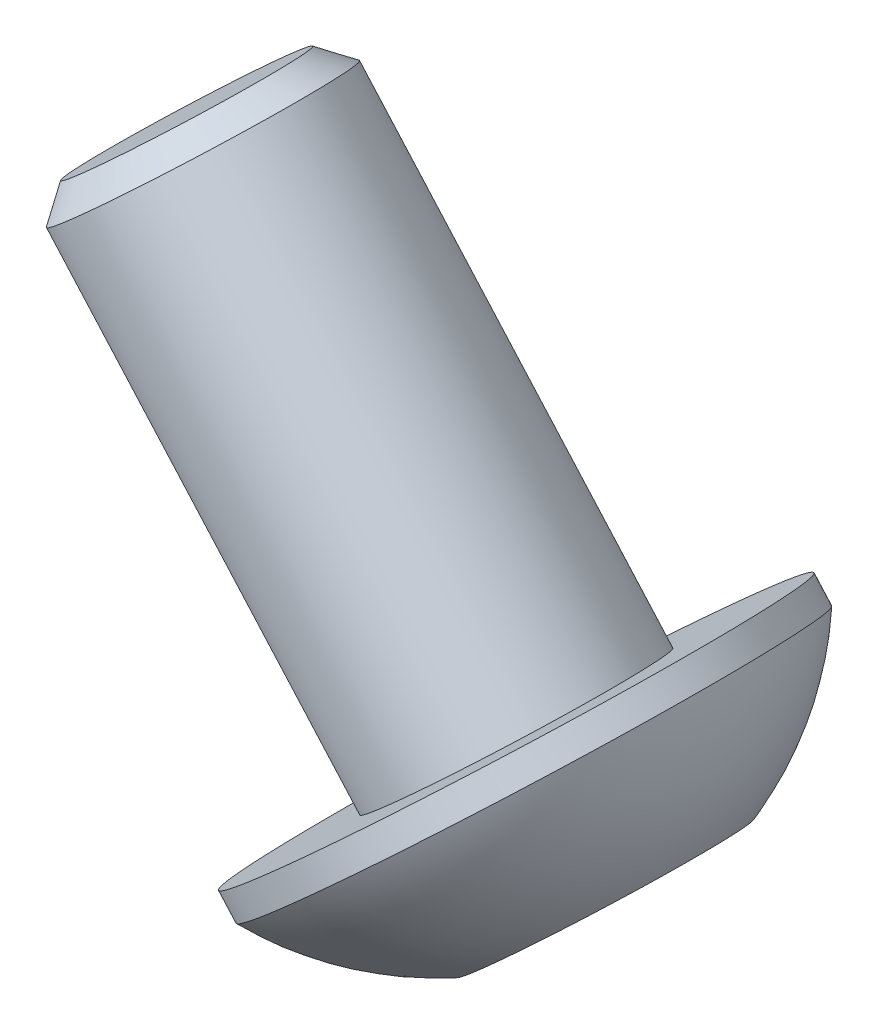
ISO-10303-21;
HEADER;
FILE_DESCRIPTION(('STEP AP214'),'2;1');
FILE_NAME('part.step','',(''),(''),'','','');
FILE_SCHEMA(('AUTOMOTIVE_DESIGN { 1 0 10303 214 1 1 1 1 }'));
ENDSEC;
DATA;
#1=APPLICATION_CONTEXT('core data for automotive mechanical design processes');
#2=APPLICATION_PROTOCOL_DEFINITION('international standard','automotive_design',2000,#1);
#3=PRODUCT_CONTEXT('',#1,'mechanical');
#4=PRODUCT('Part','Part','',(#3));
#5=PRODUCT_RELATED_PRODUCT_CATEGORY('part','',(#4));
#6=PRODUCT_DEFINITION_FORMATION('','',#4);
#7=PRODUCT_DEFINITION_CONTEXT('part definition',#1,'design');
#8=PRODUCT_DEFINITION('design','',#6,#7);
#9=PRODUCT_DEFINITION_SHAPE('','',#8);
#10=(LENGTH_UNIT() NAMED_UNIT(*) SI_UNIT(.MILLI.,.METRE.));
#11=(NAMED_UNIT(*) PLANE_ANGLE_UNIT() SI_UNIT($,.RADIAN.));
#12=(NAMED_UNIT(*) SI_UNIT($,.STERADIAN.) SOLID_ANGLE_UNIT());
#13=UNCERTAINTY_MEASURE_WITH_UNIT(LENGTH_MEASURE(1.E-05),#10,'distance_accuracy_value','');
#14=(GEOMETRIC_REPRESENTATION_CONTEXT(3) GLOBAL_UNCERTAINTY_ASSIGNED_CONTEXT((#13)) GLOBAL_UNIT_ASSIGNED_CONTEXT((#10,
#11,#12)) REPRESENTATION_CONTEXT('',''));
#15=CARTESIAN_POINT('',(0.,0.,0.));
#16=DIRECTION('',(0.,0.,1.));
#17=DIRECTION('',(1.,0.,0.));
#18=AXIS2_PLACEMENT_3D('',#15,#16,#17);
#19=CARTESIAN_POINT('',(80.7619107019577,-15.7951499203464,-42.3844999999999));
#20=DIRECTION('',(0.664699798962186,-0.747110552234159,0.));
#21=DIRECTION('',(0.747110552234159,0.664699798962186,0.));
#22=AXIS2_PLACEMENT_3D('',#19,#20,#21);
#23=CONICAL_SURFACE('',#22,1.58750000000284,1.04719755119654);
#24=CARTESIAN_POINT('',(80.1526843869771,-15.1103905608109,-42.3844999999999));
#25=VERTEX_POINT('',#24);
#26=VERTEX_LOOP('',#25);
#27=FACE_BOUND('',#26,.T.);
#28=CARTESIAN_POINT('',(80.7619107019576,-15.7951499203463,-42.3844999999999));
#29=DIRECTION('',(0.664699798962185,-0.747110552234159,0.));
#30=DIRECTION('',(0.747110552234159,0.664699798962185,0.));
#31=AXIS2_PLACEMENT_3D('',#28,#29,#30);
#32=CIRCLE('',#31,1.5875000000028);
#33=CARTESIAN_POINT('',(80.360317561987,-16.1524449399484,-40.8907732951104));
#34=VERTEX_POINT('',#33);
#35=CARTESIAN_POINT('',(81.5275802816676,-15.1139382654177,-41.1721233976598));
#36=VERTEX_POINT('',#35);
#37=EDGE_CURVE('E88',#34,#36,#32,.F.);
#38=ORIENTED_EDGE('',*,*,#37,.F.);
#39=CARTESIAN_POINT('',(80.7619107019575,-15.7951499203461,-42.3844999999999));
#40=DIRECTION('',(0.664699798962186,-0.747110552234159,0.));
#41=DIRECTION('',(0.747110552234159,0.664699798962186,0.));
#42=AXIS2_PLACEMENT_3D('',#39,#40,#41);
#43=CIRCLE('',#42,1.58750000000214);
#44=CARTESIAN_POINT('',(79.5946479822795,-16.8336565948782,-42.1031498974503));
#45=VERTEX_POINT('',#44);
#46=EDGE_CURVE('E90',#34,#45,#43,.T.);
#47=ORIENTED_EDGE('',*,*,#46,.T.);
#48=CARTESIAN_POINT('',(80.7619107019576,-15.7951499203463,-42.3844999999999));
#49=DIRECTION('',(0.664699798962186,-0.747110552234159,0.));
#50=DIRECTION('',(0.747110552234159,0.664699798962186,0.));
#51=AXIS2_PLACEMENT_3D('',#48,#49,#50);
#52=CIRCLE('',#51,1.58750000000259);
#53=CARTESIAN_POINT('',(79.9962411222521,-16.4763615752782,-43.5968766023401));
#54=VERTEX_POINT('',#53);
#55=EDGE_CURVE('E106',#45,#54,#52,.T.);
#56=ORIENTED_EDGE('',*,*,#55,.T.);
#57=CARTESIAN_POINT('',(80.7619107019577,-15.7951499203464,-42.3844999999999));
#58=DIRECTION('',(0.664699798962186,-0.747110552234159,0.));
#59=DIRECTION('',(0.747110552234159,0.664699798962186,0.));
#60=AXIS2_PLACEMENT_3D('',#57,#58,#59);
#61=CIRCLE('',#60,1.58750000000284);
#62=CARTESIAN_POINT('',(81.1635038419326,-15.4378549007474,-43.8782267048898));
#63=VERTEX_POINT('',#62);
#64=EDGE_CURVE('E316',#54,#63,#61,.T.);
#65=ORIENTED_EDGE('',*,*,#64,.T.);
#66=CARTESIAN_POINT('',(80.761910701958,-15.7951499203467,-42.3844999999999));
#67=DIRECTION('',(0.664699798962185,-0.747110552234159,0.));
#68=DIRECTION('',(0.747110552234159,0.664699798962185,0.));
#69=AXIS2_PLACEMENT_3D('',#66,#67,#68);
#70=CIRCLE('',#69,1.58750000000375);
#71=CARTESIAN_POINT('',(81.9291734216403,-14.7566432458173,-42.6658501025492));
#72=VERTEX_POINT('',#71);
#73=EDGE_CURVE('E318',#72,#63,#70,.F.);
#74=ORIENTED_EDGE('',*,*,#73,.F.);
#75=CARTESIAN_POINT('',(80.7619107019579,-15.7951499203467,-42.3844999999999));
#76=DIRECTION('',(0.664699798962185,-0.747110552234159,0.));
#77=DIRECTION('',(0.747110552234159,0.664699798962185,0.));
#78=AXIS2_PLACEMENT_3D('',#75,#76,#77);
#79=CIRCLE('',#78,1.58750000000355);
#80=EDGE_CURVE('E93',#36,#72,#79,.F.);
#81=ORIENTED_EDGE('',*,*,#80,.F.);
#82=EDGE_LOOP('',(#38,#47,#56,#65,#74,#81));
#83=FACE_BOUND('',#82,.T.);
#84=ADVANCED_FACE('F16',(#27,#83),#23,.F.);
#85=CARTESIAN_POINT('',(83.0964361413198,-13.7181365712904,-42.9472002050976));
#86=DIRECTION('',(-0.664699798962185,0.747110552234159,0.));
#87=DIRECTION('',(-0.747110552234159,-0.664699798962185,0.));
#88=AXIS2_PLACEMENT_3D('',#85,#86,#87);
#89=PLANE('',#88);
#90=DIRECTION('',(0.570569671111538,0.507632430766113,-0.645569179594379));
#91=VECTOR('',#90,1.);
#92=CARTESIAN_POINT('',(81.0046283284516,-15.5792054967968,-40.5804311285149));
#93=LINE('',#92,#91);
#94=CARTESIAN_POINT('',(81.0046283284516,-15.5792054967968,-40.5804311285149));
#95=VERTEX_POINT('',#94);
#96=EDGE_CURVE('E111',#95,#36,#93,.T.);
#97=ORIENTED_EDGE('',*,*,#96,.F.);
#98=DIRECTION('',(0.702978887166101,0.625436119964289,0.338600567103374));
#99=VECTOR('',#98,1.);
#100=CARTESIAN_POINT('',(80.3603175619894,-16.1524449399496,-40.8907732951117));
#101=LINE('',#100,#99);
#102=EDGE_CURVE('E109',#34,#95,#101,.T.);
#103=ORIENTED_EDGE('',*,*,#102,.F.);
#104=ORIENTED_EDGE('',*,*,#37,.T.);
#105=EDGE_LOOP('',(#97,#103,#104));
#106=FACE_BOUND('',#105,.T.);
#107=ADVANCED_FACE('F110',(#106),#89,.F.);
#108=CARTESIAN_POINT('',(83.0964361413198,-13.7181365712904,-42.9472002050976));
#109=DIRECTION('',(-0.664699798962185,0.747110552234159,0.));
#110=DIRECTION('',(-0.747110552234159,-0.664699798962185,0.));
#111=AXIS2_PLACEMENT_3D('',#108,#109,#110);
#112=PLANE('',#111);
#113=DIRECTION('',(0.132409216054471,0.117803689198278,0.984169746697751));
#114=VECTOR('',#113,1.);
#115=CARTESIAN_POINT('',(81.8078146083959,-14.8646154575964,-43.5678845382916));
#116=LINE('',#115,#114);
#117=CARTESIAN_POINT('',(82.0505322348858,-14.6486710340436,-41.7638156668065));
#118=VERTEX_POINT('',#117);
#119=EDGE_CURVE('E159',#118,#72,#116,.F.);
#120=ORIENTED_EDGE('',*,*,#119,.F.);
#121=DIRECTION('',(0.570569671111515,0.507632430766135,-0.645569179594382));
#122=VECTOR('',#121,1.);
#123=CARTESIAN_POINT('',(81.5275802816688,-15.1139382654201,-41.1721233976607));
#124=LINE('',#123,#122);
#125=EDGE_CURVE('E171',#36,#118,#124,.T.);
#126=ORIENTED_EDGE('',*,*,#125,.F.);
#127=ORIENTED_EDGE('',*,*,#80,.T.);
#128=EDGE_LOOP('',(#120,#126,#127));
#129=FACE_BOUND('',#128,.T.);
#130=ADVANCED_FACE('F247',(#129),#112,.F.);
#131=CARTESIAN_POINT('',(83.0964361413198,-13.7181365712904,-42.9472002050976));
#132=DIRECTION('',(-0.664699798962185,0.747110552234159,0.));
#133=DIRECTION('',(-0.747110552234159,-0.664699798962185,0.));
#134=AXIS2_PLACEMENT_3D('',#131,#132,#133);
#135=PLANE('',#134);
#136=DIRECTION('',(-0.702978887165938,-0.625436119964469,-0.338600567103377));
#137=VECTOR('',#136,1.);
#138=CARTESIAN_POINT('',(81.8078146083957,-14.8646154575964,-43.5678845382913));
#139=LINE('',#138,#137);
#140=CARTESIAN_POINT('',(81.8078146083959,-14.8646154575965,-43.5678845382913));
#141=VERTEX_POINT('',#140);
#142=EDGE_CURVE('E143',#141,#63,#139,.T.);
#143=ORIENTED_EDGE('',*,*,#142,.F.);
#144=DIRECTION('',(0.132409216054471,0.117803689198278,0.984169746697751));
#145=VECTOR('',#144,1.);
#146=CARTESIAN_POINT('',(81.8078146083961,-14.8646154575966,-43.5678845382916));
#147=LINE('',#146,#145);
#148=EDGE_CURVE('E156',#72,#141,#147,.F.);
#149=ORIENTED_EDGE('',*,*,#148,.F.);
#150=ORIENTED_EDGE('',*,*,#73,.T.);
#151=EDGE_LOOP('',(#143,#149,#150));
#152=FACE_BOUND('',#151,.T.);
#153=ADVANCED_FACE('F243',(#152),#135,.F.);
#154=CARTESIAN_POINT('',(83.0964361413198,-13.7181365712904,-42.9472002050976));
#155=DIRECTION('',(-0.664699798962185,0.747110552234159,0.));
#156=DIRECTION('',(-0.747110552234159,-0.664699798962185,0.));
#157=AXIS2_PLACEMENT_3D('',#154,#155,#156);
#158=PLANE('',#157);
#159=DIRECTION('',(-0.570569671111317,-0.507632430766363,0.645569179594378));
#160=VECTOR('',#159,1.);
#161=CARTESIAN_POINT('',(80.5191930754717,-16.0110943439026,-44.1885688714847));
#162=LINE('',#161,#160);
#163=CARTESIAN_POINT('',(80.5191930754717,-16.0110943439026,-44.1885688714848));
#164=VERTEX_POINT('',#163);
#165=EDGE_CURVE('E128',#164,#54,#162,.T.);
#166=ORIENTED_EDGE('',*,*,#165,.F.);
#167=DIRECTION('',(-0.702978887165886,-0.62543611996453,-0.338600567103373));
#168=VECTOR('',#167,1.);
#169=CARTESIAN_POINT('',(81.1635038419336,-15.4378549007496,-43.8782267048881));
#170=LINE('',#169,#168);
#171=EDGE_CURVE('E140',#63,#164,#170,.T.);
#172=ORIENTED_EDGE('',*,*,#171,.F.);
#173=ORIENTED_EDGE('',*,*,#64,.F.);
#174=EDGE_LOOP('',(#166,#172,#173));
#175=FACE_BOUND('',#174,.T.);
#176=ADVANCED_FACE('F239',(#175),#158,.F.);
#177=CARTESIAN_POINT('',(83.0964361413198,-13.7181365712904,-42.9472002050976));
#178=DIRECTION('',(-0.664699798962185,0.747110552234159,0.));
#179=DIRECTION('',(-0.747110552234159,-0.664699798962185,0.));
#180=AXIS2_PLACEMENT_3D('',#177,#178,#179);
#181=PLANE('',#180);
#182=DIRECTION('',(0.132409216054471,0.117803689198279,0.984169746697751));
#183=VECTOR('',#182,1.);
#184=CARTESIAN_POINT('',(79.7160067955274,-16.7256843831031,-41.2011154617082));
#185=LINE('',#184,#183);
#186=CARTESIAN_POINT('',(79.4732891690375,-16.9416288066559,-43.0051843331932));
#187=VERTEX_POINT('',#186);
#188=EDGE_CURVE('E148',#187,#45,#185,.T.);
#189=ORIENTED_EDGE('',*,*,#188,.F.);
#190=DIRECTION('',(-0.570569671111649,-0.507632430765987,0.64556917959438));
#191=VECTOR('',#190,1.);
#192=CARTESIAN_POINT('',(79.9962411222546,-16.4763615752795,-43.5968766023389));
#193=LINE('',#192,#191);
#194=EDGE_CURVE('E125',#54,#187,#193,.T.);
#195=ORIENTED_EDGE('',*,*,#194,.F.);
#196=ORIENTED_EDGE('',*,*,#55,.F.);
#197=EDGE_LOOP('',(#189,#195,#196));
#198=FACE_BOUND('',#197,.T.);
#199=ADVANCED_FACE('F236',(#198),#181,.F.);
#200=CARTESIAN_POINT('',(83.0964361413198,-13.7181365712904,-42.9472002050976));
#201=DIRECTION('',(-0.664699798962185,0.747110552234159,0.));
#202=DIRECTION('',(-0.747110552234159,-0.664699798962185,0.));
#203=AXIS2_PLACEMENT_3D('',#200,#201,#202);
#204=PLANE('',#203);
#205=DIRECTION('',(0.702978887165781,0.625436119964652,0.338600567103367));
#206=VECTOR('',#205,1.);
#207=CARTESIAN_POINT('',(79.7160067955274,-16.7256843831029,-41.2011154617085));
#208=LINE('',#207,#206);
#209=CARTESIAN_POINT('',(79.7160067955273,-16.7256843831029,-41.2011154617083));
#210=VERTEX_POINT('',#209);
#211=EDGE_CURVE('E101',#210,#34,#208,.T.);
#212=ORIENTED_EDGE('',*,*,#211,.F.);
#213=DIRECTION('',(0.132409216054471,0.117803689198279,0.984169746697751));
#214=VECTOR('',#213,1.);
#215=CARTESIAN_POINT('',(79.7160067955272,-16.7256843831028,-41.2011154617082));
#216=LINE('',#215,#214);
#217=EDGE_CURVE('E104',#45,#210,#216,.T.);
#218=ORIENTED_EDGE('',*,*,#217,.F.);
#219=ORIENTED_EDGE('',*,*,#46,.F.);
#220=EDGE_LOOP('',(#212,#218,#219));
#221=FACE_BOUND('',#220,.T.);
#222=ADVANCED_FACE('F99',(#221),#204,.F.);
#223=CARTESIAN_POINT('',(81.0046283284516,-15.5792054967967,-40.5804311285149));
#224=DIRECTION('',(0.2529720566754,0.225067728882094,-0.940930207803573));
#225=DIRECTION('',(-0.965707241664354,0.,-0.259633440444457));
#226=AXIS2_PLACEMENT_3D('',#223,#224,#225);
#227=PLANE('',#226);
#228=DIRECTION('',(0.702978887165965,0.625436119964515,0.338600567103238));
#229=VECTOR('',#228,1.);
#230=CARTESIAN_POINT('',(80.8978430380818,-18.0540469449756,-41.2011154617084));
#231=LINE('',#230,#229);
#232=CARTESIAN_POINT('',(80.8978430380819,-18.0540469449755,-41.2011154617085));
#233=VERTEX_POINT('',#232);
#234=CARTESIAN_POINT('',(82.1864645710058,-16.9075680586693,-40.580431128515));
#235=VERTEX_POINT('',#234);
#236=EDGE_CURVE('E132',#233,#235,#231,.T.);
#237=ORIENTED_EDGE('',*,*,#236,.F.);
#238=DIRECTION('',(-0.664699798962186,0.747110552234159,0.));
#239=VECTOR('',#238,1.);
#240=CARTESIAN_POINT('',(79.7160067955273,-16.725684383103,-41.2011154617082));
#241=LINE('',#240,#239);
#242=EDGE_CURVE('E117',#210,#233,#241,.F.);
#243=ORIENTED_EDGE('',*,*,#242,.F.);
#244=ORIENTED_EDGE('',*,*,#211,.T.);
#245=ORIENTED_EDGE('',*,*,#102,.T.);
#246=DIRECTION('',(-0.664699798962094,0.747110552234241,0.));
#247=VECTOR('',#246,1.);
#248=CARTESIAN_POINT('',(82.186464571006,-16.9075680586691,-40.5804311285148));
#249=LINE('',#248,#247);
#250=EDGE_CURVE('E168',#235,#95,#249,.T.);
#251=ORIENTED_EDGE('',*,*,#250,.F.);
#252=EDGE_LOOP('',(#237,#243,#244,#245,#251));
#253=FACE_BOUND('',#252,.T.);
#254=ADVANCED_FACE('F115',(#253),#227,.T.);
#255=CARTESIAN_POINT('',(82.0505322348859,-14.6486710340435,-41.7638156668064));
#256=DIRECTION('',(-0.48231154627211,-0.429109703892566,-0.763701796749124));
#257=DIRECTION('',(-0.84550211395615,0.,0.53397207351666));
#258=AXIS2_PLACEMENT_3D('',#255,#256,#257);
#259=PLANE('',#258);
#260=DIRECTION('',(0.570569671111426,0.507632430766176,-0.645569179594428));
#261=VECTOR('',#260,1.);
#262=CARTESIAN_POINT('',(82.1864645710059,-16.9075680586695,-40.5804311285152));
#263=LINE('',#262,#261);
#264=CARTESIAN_POINT('',(83.2323684774403,-15.977033595916,-41.7638156668064));
#265=VERTEX_POINT('',#264);
#266=EDGE_CURVE('E301',#235,#265,#263,.T.);
#267=ORIENTED_EDGE('',*,*,#266,.F.);
#268=ORIENTED_EDGE('',*,*,#250,.T.);
#269=ORIENTED_EDGE('',*,*,#96,.T.);
#270=ORIENTED_EDGE('',*,*,#125,.T.);
#271=DIRECTION('',(0.664699798962185,-0.74711055223416,0.));
#272=VECTOR('',#271,1.);
#273=CARTESIAN_POINT('',(82.0505322348857,-14.6486710340436,-41.7638156668067));
#274=LINE('',#273,#272);
#275=EDGE_CURVE('E153',#265,#118,#274,.F.);
#276=ORIENTED_EDGE('',*,*,#275,.F.);
#277=EDGE_LOOP('',(#267,#268,#269,#270,#276));
#278=FACE_BOUND('',#277,.T.);
#279=ADVANCED_FACE('F227',(#278),#259,.T.);
#280=CARTESIAN_POINT('',(81.8078146083958,-14.8646154575964,-43.5678845382916));
#281=DIRECTION('',(-0.73528360294751,-0.65417743277466,0.177228411054447));
#282=DIRECTION('',(0.664699798962185,-0.74711055223416,0.));
#283=AXIS2_PLACEMENT_3D('',#280,#281,#282);
#284=PLANE('',#283);
#285=DIRECTION('',(-0.132409216054484,-0.117803689198291,-0.984169746697748));
#286=VECTOR('',#285,1.);
#287=CARTESIAN_POINT('',(83.2323684774401,-15.9770335959161,-41.7638156668066));
#288=LINE('',#287,#286);
#289=CARTESIAN_POINT('',(82.9896508509504,-16.1929780194688,-43.5678845382916));
#290=VERTEX_POINT('',#289);
#291=EDGE_CURVE('E298',#265,#290,#288,.T.);
#292=ORIENTED_EDGE('',*,*,#291,.F.);
#293=ORIENTED_EDGE('',*,*,#275,.T.);
#294=ORIENTED_EDGE('',*,*,#119,.T.);
#295=ORIENTED_EDGE('',*,*,#148,.T.);
#296=DIRECTION('',(-0.664699798962021,0.747110552234305,0.));
#297=VECTOR('',#296,1.);
#298=CARTESIAN_POINT('',(82.9896508509502,-16.192978019469,-43.5678845382914));
#299=LINE('',#298,#297);
#300=EDGE_CURVE('E137',#290,#141,#299,.T.);
#301=ORIENTED_EDGE('',*,*,#300,.F.);
#302=EDGE_LOOP('',(#292,#293,#294,#295,#301));
#303=FACE_BOUND('',#302,.T.);
#304=ADVANCED_FACE('F223',(#303),#284,.T.);
#305=CARTESIAN_POINT('',(80.5191930754716,-16.0110943439027,-44.1885688714848));
#306=DIRECTION('',(-0.2529720566754,-0.225067728882094,0.940930207803573));
#307=DIRECTION('',(0.965707241664354,0.,0.259633440444457));
#308=AXIS2_PLACEMENT_3D('',#305,#306,#307);
#309=PLANE('',#308);
#310=DIRECTION('',(-0.702978887165984,-0.62543611996453,-0.33860056710317));
#311=VECTOR('',#310,1.);
#312=CARTESIAN_POINT('',(82.9896508509502,-16.1929780194689,-43.5678845382916));
#313=LINE('',#312,#311);
#314=CARTESIAN_POINT('',(81.7010293180259,-17.3394569057752,-44.1885688714848));
#315=VERTEX_POINT('',#314);
#316=EDGE_CURVE('E295',#290,#315,#313,.T.);
#317=ORIENTED_EDGE('',*,*,#316,.F.);
#318=ORIENTED_EDGE('',*,*,#300,.T.);
#319=ORIENTED_EDGE('',*,*,#142,.T.);
#320=ORIENTED_EDGE('',*,*,#171,.T.);
#321=DIRECTION('',(-0.664699798962043,0.747110552234286,-1.6000823962893E-13));
#322=VECTOR('',#321,1.);
#323=CARTESIAN_POINT('',(81.701029318026,-17.339456905775,-44.1885688714844));
#324=LINE('',#323,#322);
#325=EDGE_CURVE('E127',#315,#164,#324,.T.);
#326=ORIENTED_EDGE('',*,*,#325,.F.);
#327=EDGE_LOOP('',(#317,#318,#319,#320,#326));
#328=FACE_BOUND('',#327,.T.);
#329=ADVANCED_FACE('F220',(#328),#309,.T.);
#330=CARTESIAN_POINT('',(79.4732891690372,-16.9416288066561,-43.0051843331931));
#331=DIRECTION('',(0.482311546272109,0.429109703892566,0.763701796749125));
#332=DIRECTION('',(0.845502113956151,0.,-0.533972073516659));
#333=AXIS2_PLACEMENT_3D('',#330,#331,#332);
#334=PLANE('',#333);
#335=DIRECTION('',(-0.570569671111371,-0.507632430766128,0.645569179594514));
#336=VECTOR('',#335,1.);
#337=CARTESIAN_POINT('',(81.7010293180258,-17.3394569057753,-44.1885688714848));
#338=LINE('',#337,#336);
#339=CARTESIAN_POINT('',(80.6551254115918,-18.2699913685284,-43.0051843331931));
#340=VERTEX_POINT('',#339);
#341=EDGE_CURVE('E292',#315,#340,#338,.T.);
#342=ORIENTED_EDGE('',*,*,#341,.F.);
#343=ORIENTED_EDGE('',*,*,#325,.T.);
#344=ORIENTED_EDGE('',*,*,#165,.T.);
#345=ORIENTED_EDGE('',*,*,#194,.T.);
#346=DIRECTION('',(-0.664699798962186,0.747110552234159,0.));
#347=VECTOR('',#346,1.);
#348=CARTESIAN_POINT('',(79.4732891690375,-16.9416288066558,-43.0051843331933));
#349=LINE('',#348,#347);
#350=EDGE_CURVE('E34',#340,#187,#349,.T.);
#351=ORIENTED_EDGE('',*,*,#350,.F.);
#352=EDGE_LOOP('',(#342,#343,#344,#345,#351));
#353=FACE_BOUND('',#352,.T.);
#354=ADVANCED_FACE('F216',(#353),#334,.T.);
#355=CARTESIAN_POINT('',(79.7160067955273,-16.725684383103,-41.2011154617082));
#356=DIRECTION('',(0.735283602947509,0.65417743277466,-0.177228411054447));
#357=DIRECTION('',(-0.664699798962186,0.747110552234159,0.));
#358=AXIS2_PLACEMENT_3D('',#355,#356,#357);
#359=PLANE('',#358);
#360=DIRECTION('',(0.132409216054649,0.117803689198438,0.984169746697708));
#361=VECTOR('',#360,1.);
#362=CARTESIAN_POINT('',(80.6551254115917,-18.2699913685286,-43.0051843331931));
#363=LINE('',#362,#361);
#364=EDGE_CURVE('E197',#340,#233,#363,.T.);
#365=ORIENTED_EDGE('',*,*,#364,.F.);
#366=ORIENTED_EDGE('',*,*,#350,.T.);
#367=ORIENTED_EDGE('',*,*,#188,.T.);
#368=ORIENTED_EDGE('',*,*,#217,.T.);
#369=ORIENTED_EDGE('',*,*,#242,.T.);
#370=EDGE_LOOP('',(#365,#366,#367,#368,#369));
#371=FACE_BOUND('',#370,.T.);
#372=ADVANCED_FACE('F212',(#371),#359,.T.);
#373=CARTESIAN_POINT('',(81.9437469445159,-17.1235124822224,-42.3845000000001));
#374=DIRECTION('',(0.664699798962186,-0.747110552234159,0.));
#375=DIRECTION('',(0.747110552234159,0.664699798962186,0.));
#376=AXIS2_PLACEMENT_3D('',#373,#374,#375);
#377=PLANE('',#376);
#378=ORIENTED_EDGE('',*,*,#341,.T.);
#379=ORIENTED_EDGE('',*,*,#364,.T.);
#380=ORIENTED_EDGE('',*,*,#236,.T.);
#381=ORIENTED_EDGE('',*,*,#266,.T.);
#382=ORIENTED_EDGE('',*,*,#291,.T.);
#383=ORIENTED_EDGE('',*,*,#316,.T.);
#384=EDGE_LOOP('',(#378,#379,#380,#381,#382,#383));
#385=FACE_BOUND('',#384,.T.);
#386=CARTESIAN_POINT('',(80.3322732925169,-18.5572309718229,-43.1606910099993));
#387=CARTESIAN_POINT('',(80.3156046295523,-18.5720609817693,-43.0986905580934));
#388=CARTESIAN_POINT('',(80.3009307507426,-18.5851162441643,-43.035713530822));
#389=CARTESIAN_POINT('',(80.2756877161113,-18.6075748214075,-42.9082882782958));
#390=CARTESIAN_POINT('',(80.2651199856453,-18.6169768681254,-42.8438395503786));
#391=CARTESIAN_POINT('',(80.2481586332432,-18.6320672821177,-42.7138468337012));
#392=CARTESIAN_POINT('',(80.2417720892034,-18.6377493522302,-42.6483011793832));
#393=CARTESIAN_POINT('',(80.2332439700472,-18.6453367689409,-42.5166809110846));
#394=CARTESIAN_POINT('',(80.2311057997741,-18.6472390862704,-42.450605915409));
#395=CARTESIAN_POINT('',(80.2311124941416,-18.6472331303317,-42.2556837254309));
#396=CARTESIAN_POINT('',(80.2392445496502,-18.6399980890848,-42.1267500431656));
#397=CARTESIAN_POINT('',(80.2715881992608,-18.6112221370784,-41.8725458160994));
#398=CARTESIAN_POINT('',(80.2957998793613,-18.5896811498065,-41.7472752908937));
#399=CARTESIAN_POINT('',(80.3435983675847,-18.547155120135,-41.5648615137157));
#400=CARTESIAN_POINT('',(80.3614601736665,-18.5312635778786,-41.5049347772704));
#401=CARTESIAN_POINT('',(80.4008767522768,-18.4961948831595,-41.3873506387165));
#402=CARTESIAN_POINT('',(80.4224279705403,-18.4770208929054,-41.3296911175781));
#403=CARTESIAN_POINT('',(80.4690939555701,-18.4355024445647,-41.2169802587961));
#404=CARTESIAN_POINT('',(80.4942103947402,-18.4131564985505,-41.1619301614615));
#405=CARTESIAN_POINT('',(80.5478145160859,-18.3654652317416,-41.0548554662449));
#406=CARTESIAN_POINT('',(80.5763029726255,-18.3401192219998,-41.0028315674188));
#407=CARTESIAN_POINT('',(80.6665236487169,-18.2598504249906,-40.8518989150352));
#408=CARTESIAN_POINT('',(80.7330609023243,-18.2006526276055,-40.7580093600171));
#409=CARTESIAN_POINT('',(80.8769324640936,-18.0726509578421,-40.5865694613149));
#410=CARTESIAN_POINT('',(80.9542666261494,-18.0038472154537,-40.5090188965635));
#411=CARTESIAN_POINT('',(81.11757314693,-17.8585543786605,-40.3723812570765));
#412=CARTESIAN_POINT('',(81.2035455643143,-17.7820652320667,-40.3132943077323));
#413=CARTESIAN_POINT('',(81.3816825666802,-17.6235778043276,-40.2152832901011));
#414=CARTESIAN_POINT('',(81.4738471513452,-17.541579523464,-40.1763592207829));
#415=CARTESIAN_POINT('',(81.661736830339,-17.3744151975409,-40.1197686542916));
#416=CARTESIAN_POINT('',(81.7574619042091,-17.2892491706834,-40.1021020349914));
#417=CARTESIAN_POINT('',(81.9498212854624,-17.1181081773389,-40.0885476376462));
#418=CARTESIAN_POINT('',(82.0464556033268,-17.0321332015267,-40.0926601109651));
#419=CARTESIAN_POINT('',(82.1898985826822,-16.904512838978,-40.1150306564766));
#420=CARTESIAN_POINT('',(82.2374859286945,-16.8621746612707,-40.1251973514426));
#421=CARTESIAN_POINT('',(82.3318532503597,-16.7782166184457,-40.1508574378995));
#422=CARTESIAN_POINT('',(82.3786334104633,-16.7365965892234,-40.166349595072));
#423=CARTESIAN_POINT('',(82.4710303747374,-16.6543915616086,-40.2025476612186));
#424=CARTESIAN_POINT('',(82.5166477006841,-16.613806098995,-40.2232511847738));
#425=CARTESIAN_POINT('',(82.6064525033809,-16.5339073020634,-40.2697383821595));
#426=CARTESIAN_POINT('',(82.6506385573296,-16.4945952336033,-40.2955269407717));
#427=CARTESIAN_POINT('',(82.7804668535354,-16.3790877733894,-40.380212659006));
#428=CARTESIAN_POINT('',(82.8635014749205,-16.3052123663609,-40.4464779255726));
#429=CARTESIAN_POINT('',(83.0200621056721,-16.1659213076619,-40.5967483291385));
#430=CARTESIAN_POINT('',(83.0935884908711,-16.1005053216152,-40.6807527646149));
#431=CARTESIAN_POINT('',(83.19519853706,-16.010103470012,-40.8182178538917));
#432=CARTESIAN_POINT('',(83.2276559033726,-15.9812263449356,-40.8660139799026));
#433=CARTESIAN_POINT('',(83.2894268196489,-15.9262691294234,-40.9650720610131));
#434=CARTESIAN_POINT('',(83.3187428853679,-15.9001868007351,-41.0163311882524));
#435=CARTESIAN_POINT('',(83.3739933313574,-15.8510308087177,-41.1218827651584));
#436=CARTESIAN_POINT('',(83.3999332335377,-15.8279522325782,-41.1761700488954));
#437=CARTESIAN_POINT('',(83.4483025208085,-15.7849183664004,-41.2874639329956));
#438=CARTESIAN_POINT('',(83.4707330087956,-15.7649620951216,-41.3444696716573));
#439=CARTESIAN_POINT('',(83.5032144485822,-15.736063552019,-41.4361879641375));
#440=CARTESIAN_POINT('',(83.5144893107374,-15.726032374457,-41.4701338240782));
#441=CARTESIAN_POINT('',(83.5357942959337,-15.7070774562933,-41.5387193319438));
#442=CARTESIAN_POINT('',(83.5458243812892,-15.6981537492201,-41.5733590008369));
#443=CARTESIAN_POINT('',(83.5718892594743,-15.6749639826752,-41.670309441907));
#444=CARTESIAN_POINT('',(83.5865631382879,-15.6619087202803,-41.7332864691777));
#445=CARTESIAN_POINT('',(83.6118061729219,-15.6394501430372,-41.8607117217035));
#446=CARTESIAN_POINT('',(83.6223739033869,-15.6300480963193,-41.925160449621));
#447=CARTESIAN_POINT('',(83.6393352557883,-15.6149576823269,-42.0551531662986));
#448=CARTESIAN_POINT('',(83.6457217998284,-15.6092756122145,-42.1206988206165));
#449=CARTESIAN_POINT('',(83.6542499189848,-15.6016881955037,-42.252319088915));
#450=CARTESIAN_POINT('',(83.6563880892578,-15.5997858781741,-42.3183940845907));
#451=CARTESIAN_POINT('',(83.6563813948904,-15.599791834113,-42.513316274569));
#452=CARTESIAN_POINT('',(83.6482493393822,-15.6070268753604,-42.6422499568343));
#453=CARTESIAN_POINT('',(83.6159056897706,-15.6358028273657,-42.8964541839005));
#454=CARTESIAN_POINT('',(83.5916940096688,-15.657343814636,-43.0217247091061));
#455=CARTESIAN_POINT('',(83.5438955214462,-15.6998698443085,-43.2041384862841));
#456=CARTESIAN_POINT('',(83.5260337153652,-15.7157613865658,-43.2640652227294));
#457=CARTESIAN_POINT('',(83.4866171367554,-15.7508300812854,-43.3816493612833));
#458=CARTESIAN_POINT('',(83.4650659184917,-15.7700040715393,-43.4393088824217));
#459=CARTESIAN_POINT('',(83.4183999334618,-15.8115225198799,-43.5520197412037));
#460=CARTESIAN_POINT('',(83.3932834942919,-15.8338684658944,-43.6070698385384));
#461=CARTESIAN_POINT('',(83.3396793729458,-15.8815597327028,-43.7141445337549));
#462=CARTESIAN_POINT('',(83.3111909164055,-15.9069057424438,-43.766168432581));
#463=CARTESIAN_POINT('',(83.2209702403134,-15.9871745394522,-43.9171010849645));
#464=CARTESIAN_POINT('',(83.1544329867073,-16.0463723368386,-44.0109906399826));
#465=CARTESIAN_POINT('',(83.0105614249388,-16.1743740066029,-44.1824305386848));
#466=CARTESIAN_POINT('',(82.9332272628827,-16.2431777489911,-44.2599811034363));
#467=CARTESIAN_POINT('',(82.7699207421018,-16.388470585784,-44.3966187429233));
#468=CARTESIAN_POINT('',(82.6839483247176,-16.4649597323779,-44.4557056922675));
#469=CARTESIAN_POINT('',(82.5058113223518,-16.623447160117,-44.5537167098987));
#470=CARTESIAN_POINT('',(82.4136467376867,-16.7054454409806,-44.5926407792169));
#471=CARTESIAN_POINT('',(82.2257570586929,-16.8726097669037,-44.6492313457081));
#472=CARTESIAN_POINT('',(82.1300319848228,-16.9577757937612,-44.6668979650083));
#473=CARTESIAN_POINT('',(81.9376726035695,-17.1289167871058,-44.6804523623536));
#474=CARTESIAN_POINT('',(81.8410382857051,-17.2148917629179,-44.6763398890347));
#475=CARTESIAN_POINT('',(81.6975953063497,-17.3425121254666,-44.6539693435231));
#476=CARTESIAN_POINT('',(81.6500079603374,-17.3848503031739,-44.6438026485572));
#477=CARTESIAN_POINT('',(81.5556406386723,-17.4688083459988,-44.6181425621003));
#478=CARTESIAN_POINT('',(81.5088604785686,-17.5104283752212,-44.6026504049278));
#479=CARTESIAN_POINT('',(81.4164635142945,-17.592633402836,-44.5664523387812));
#480=CARTESIAN_POINT('',(81.3708461883478,-17.6332188654496,-44.5457488152259));
#481=CARTESIAN_POINT('',(81.281041385651,-17.7131176623812,-44.4992616178403));
#482=CARTESIAN_POINT('',(81.2368553317023,-17.7524297308413,-44.4734730592281));
#483=CARTESIAN_POINT('',(81.1070270354965,-17.8679371910552,-44.3887873409937));
#484=CARTESIAN_POINT('',(81.0239924141114,-17.9418125980837,-44.3225220744272));
#485=CARTESIAN_POINT('',(80.8674317833598,-18.0811036567828,-44.1722516708612));
#486=CARTESIAN_POINT('',(80.7939053981607,-18.1465196428294,-44.0882472353848));
#487=CARTESIAN_POINT('',(80.6922953519719,-18.2369214944326,-43.9507821461081));
#488=CARTESIAN_POINT('',(80.6598379856594,-18.265798619509,-43.9029860200972));
#489=CARTESIAN_POINT('',(80.5980670693832,-18.3207558350211,-43.8039279389868));
#490=CARTESIAN_POINT('',(80.5687510036641,-18.3468381637094,-43.7526688117475));
#491=CARTESIAN_POINT('',(80.5135005576747,-18.3959941557268,-43.6471172348415));
#492=CARTESIAN_POINT('',(80.4875606554945,-18.4190727318663,-43.5928299511044));
#493=CARTESIAN_POINT('',(80.4391913682233,-18.4621065980442,-43.4815360670042));
#494=CARTESIAN_POINT('',(80.4167608802358,-18.482062869323,-43.4245303283426));
#495=CARTESIAN_POINT('',(80.38427944045,-18.5109614124257,-43.3328120358619));
#496=CARTESIAN_POINT('',(80.3730045782952,-18.5209925899878,-43.2988661759209));
#497=CARTESIAN_POINT('',(80.3516995930972,-18.5399475081514,-43.2302806680554));
#498=CARTESIAN_POINT('',(80.3416695077392,-18.5488712152245,-43.1956409991628));
#499=CARTESIAN_POINT('',(80.3322732925169,-18.5572309718229,-43.1606910099993));
#500=B_SPLINE_CURVE_WITH_KNOTS('',3,(#386,#387,#388,#389,#390,#391,#392,#393,#394,#395,#396,
#397,#398,#399,#400,#401,#402,#403,#404,#405,#406,#407,#408,#409,#410,#411,#412,#413,#414,#415,
#416,#417,#418,#419,#420,#421,#422,#423,#424,#425,#426,#427,#428,#429,#430,#431,#432,#433,#434,
#435,#436,#437,#438,#439,#440,#441,#442,#443,#444,#445,#446,#447,#448,#449,#450,#451,#452,#453,
#454,#455,#456,#457,#458,#459,#460,#461,#462,#463,#464,#465,#466,#467,#468,#469,#470,#471,#472,
#473,#474,#475,#476,#477,#478,#479,#480,#481,#482,#483,#484,#485,#486,#487,#488,#489,#490,#491,
#492,#493,#494,#495,#496,#497,#498,#499),.UNSPECIFIED.,.T.,.F.,(4,2,2,2,2,2,2,2,2,2,2,2,2,2,2,2,
2,2,2,2,2,2,2,2,2,2,2,2,2,2,2,2,2,2,2,2,2,2,2,2,2,2,2,2,2,2,2,2,2,2,2,2,2,2,2,2,4),(0.,
0.197641670642221,0.395351886910349,0.593395926786676,0.791598624401894,1.17782326040157,
1.56404996205818,1.75741699681813,1.95059878542204,2.14387149468351,2.33718867431924,
2.7234169561594,3.10964001197721,3.4958656906823,3.88209134963421,4.26831478965379,
4.65454268729113,4.84785847869355,5.04112949416152,5.23431220330676,5.42768139955238,
5.81391470404963,6.20013273720833,6.39370999020267,6.58713103678777,6.78023164660094,
6.97327144864345,7.08467975239946,7.19609142819922,7.39373309884215,7.5914433151105,
7.78948735498662,7.98769005260199,8.37391468860192,8.7601413902583,8.95350842501827,
9.14669021362227,9.3399629228837,9.53328010251936,9.91950838435949,10.3057314401774,
10.6919571188824,11.0781827778344,11.464406217854,11.8506341154913,12.0439499068937,
12.2372209223616,12.4304036315069,12.6237728277525,13.0100061322498,13.3962241654085,
13.5898014184026,13.7832224649876,13.976323074801,14.1693628768436,14.2807711806002,
14.3921828564005),.UNSPECIFIED.);
#501=CARTESIAN_POINT('',(80.3322732925169,-18.5572309718229,-43.1606910099993));
#502=VERTEX_POINT('',#501);
#503=EDGE_CURVE('E194',#502,#502,#500,.T.);
#504=ORIENTED_EDGE('',*,*,#503,.F.);
#505=EDGE_LOOP('',(#504));
#506=FACE_BOUND('',#505,.T.);
#507=ADVANCED_FACE('F208',(#385,#506),#377,.T.);
#508=CARTESIAN_POINT('',(78.7133750072564,-13.4926328494379,-42.3844999999999));
#509=DIRECTION('',(0.747110552234159,0.664699798962185,0.));
#510=DIRECTION('',(0.,0.,1.));
#511=AXIS2_PLACEMENT_3D('',#508,#509,#510);
#512=SPHERICAL_SURFACE('',#511,5.37340285883187);
#513=ORIENTED_EDGE('',*,*,#503,.T.);
#514=EDGE_LOOP('',(#513));
#515=FACE_BOUND('',#514,.T.);
#516=CARTESIAN_POINT('',(80.5761935781311,-15.5864072320558,-42.3845000000001));
#517=DIRECTION('',(0.664699798962185,-0.747110552234159,0.));
#518=DIRECTION('',(0.747110552234159,0.664699798962185,0.));
#519=AXIS2_PLACEMENT_3D('',#516,#517,#518);
#520=CIRCLE('',#519,4.5847);
#521=CARTESIAN_POINT('',(84.001471326959,-12.5389580637538,-42.3845000000001));
#522=VERTEX_POINT('',#521);
#523=EDGE_CURVE('E19',#522,#522,#520,.F.);
#524=ORIENTED_EDGE('',*,*,#523,.F.);
#525=EDGE_LOOP('',(#524));
#526=FACE_BOUND('',#525,.T.);
#527=ADVANCED_FACE('F204',(#515,#526),#512,.T.);
#528=CARTESIAN_POINT('',(73.9072604951437,-8.09064706149041,-42.3844999999999));
#529=DIRECTION('',(0.664699798962186,-0.747110552234159,0.));
#530=DIRECTION('',(0.747110552234159,0.664699798962186,0.));
#531=AXIS2_PLACEMENT_3D('',#528,#529,#530);
#532=PLANE('',#531);
#533=CARTESIAN_POINT('',(73.9072604951094,-8.09064706145182,-42.3844999999999));
#534=DIRECTION('',(0.664699798962184,-0.747110552234161,0.));
#535=DIRECTION('',(0.747110552234161,0.664699798962184,0.));
#536=AXIS2_PLACEMENT_3D('',#533,#534,#535);
#537=CIRCLE('',#536,1.94055999994434);
#538=CARTESIAN_POINT('',(75.3570733483114,-6.80075721961476,-42.3844999999999));
#539=VERTEX_POINT('',#538);
#540=EDGE_CURVE('E191',#539,#539,#537,.T.);
#541=ORIENTED_EDGE('',*,*,#540,.F.);
#542=EDGE_LOOP('',(#541));
#543=FACE_BOUND('',#542,.T.);
#544=ADVANCED_FACE('F276',(#543),#532,.F.);
#545=CARTESIAN_POINT('',(81.9437469445159,-17.1235124822224,-42.3845000000001));
#546=DIRECTION('',(0.664699798962185,-0.747110552234159,0.));
#547=DIRECTION('',(0.747110552234159,0.664699798962185,0.));
#548=AXIS2_PLACEMENT_3D('',#545,#546,#547);
#549=CYLINDRICAL_SURFACE('',#548,4.5847);
#550=ORIENTED_EDGE('',*,*,#523,.T.);
#551=EDGE_LOOP('',(#550));
#552=FACE_BOUND('',#551,.T.);
#553=CARTESIAN_POINT('',(80.2385260802581,-15.2068750715207,-42.3845000000001));
#554=DIRECTION('',(0.664699798962185,-0.747110552234159,0.));
#555=DIRECTION('',(0.747110552234159,0.664699798962185,0.));
#556=AXIS2_PLACEMENT_3D('',#553,#554,#555);
#557=CIRCLE('',#556,4.5847);
#558=CARTESIAN_POINT('',(83.6638038290861,-12.1594259032187,-42.3845000000001));
#559=VERTEX_POINT('',#558);
#560=EDGE_CURVE('E188',#559,#559,#557,.T.);
#561=ORIENTED_EDGE('',*,*,#560,.T.);
#562=EDGE_LOOP('',(#561));
#563=FACE_BOUND('',#562,.T.);
#564=ADVANCED_FACE('F273',(#552,#563),#549,.T.);
#565=CARTESIAN_POINT('',(74.2212912682252,-8.44361197085508,-42.3844999999999));
#566=DIRECTION('',(0.664699798962184,-0.747110552234161,0.));
#567=DIRECTION('',(0.747110552234161,0.664699798962184,0.));
#568=AXIS2_PLACEMENT_3D('',#565,#566,#567);
#569=CONICAL_SURFACE('',#568,2.41300000011006,0.785398163423019);
#570=ORIENTED_EDGE('',*,*,#540,.T.);
#571=EDGE_LOOP('',(#570));
#572=FACE_BOUND('',#571,.T.);
#573=CARTESIAN_POINT('',(74.2212912681653,-8.44361197078807,-42.3845000000001));
#574=DIRECTION('',(0.664699798962185,-0.747110552234159,0.));
#575=DIRECTION('',(0.747110552234159,0.664699798962185,0.));
#576=AXIS2_PLACEMENT_3D('',#573,#574,#575);
#577=CIRCLE('',#576,2.41299999999999);
#578=CARTESIAN_POINT('',(76.0240690307063,-6.83969135589233,-42.3845000000001));
#579=VERTEX_POINT('',#578);
#580=EDGE_CURVE('E25',#579,#579,#577,.T.);
#581=ORIENTED_EDGE('',*,*,#580,.F.);
#582=EDGE_LOOP('',(#581));
#583=FACE_BOUND('',#582,.T.);
#584=ADVANCED_FACE('F265',(#572,#583),#569,.T.);
#585=CARTESIAN_POINT('',(78.542238025527,-16.7160524289954,-43.2015431684206));
#586=DIRECTION('',(0.664699798962186,-0.747110552234159,0.));
#587=DIRECTION('',(0.747110552234159,0.664699798962186,0.));
#588=AXIS2_PLACEMENT_3D('',#585,#586,#587);
#589=PLANE('',#588);
#590=CARTESIAN_POINT('',(80.2385260802582,-15.2068750715208,-42.3845000000001));
#591=DIRECTION('',(0.664699798962185,-0.747110552234159,0.));
#592=DIRECTION('',(0.747110552234159,0.664699798962185,0.));
#593=AXIS2_PLACEMENT_3D('',#590,#591,#592);
#594=CIRCLE('',#593,2.41299999999999);
#595=CARTESIAN_POINT('',(82.0413038427993,-13.602954456625,-42.3845000000001));
#596=VERTEX_POINT('',#595);
#597=EDGE_CURVE('E11',#596,#596,#594,.F.);
#598=ORIENTED_EDGE('',*,*,#597,.F.);
#599=EDGE_LOOP('',(#598));
#600=FACE_BOUND('',#599,.T.);
#601=ORIENTED_EDGE('',*,*,#560,.F.);
#602=EDGE_LOOP('',(#601));
#603=FACE_BOUND('',#602,.T.);
#604=ADVANCED_FACE('F259',(#600,#603),#589,.F.);
#605=CARTESIAN_POINT('',(81.9437469445159,-17.1235124822224,-42.3845000000001));
#606=DIRECTION('',(0.664699798962185,-0.747110552234159,0.));
#607=DIRECTION('',(0.747110552234159,0.664699798962185,0.));
#608=AXIS2_PLACEMENT_3D('',#605,#606,#607);
#609=CYLINDRICAL_SURFACE('',#608,2.41299999999999);
#610=ORIENTED_EDGE('',*,*,#580,.T.);
#611=EDGE_LOOP('',(#610));
#612=FACE_BOUND('',#611,.T.);
#613=ORIENTED_EDGE('',*,*,#597,.T.);
#614=EDGE_LOOP('',(#613));
#615=FACE_BOUND('',#614,.T.);
#616=ADVANCED_FACE('F257',(#612,#615),#609,.T.);
#617=CLOSED_SHELL('',(#84,#107,#130,#153,#176,#199,#222,#254,#279,#304,#329,#354,#372,#507,#527,
#544,#564,#584,#604,#616));
#618=MANIFOLD_SOLID_BREP('B1',#617);
#619=ADVANCED_BREP_SHAPE_REPRESENTATION('',(#18,#618),#14);
#620=SHAPE_DEFINITION_REPRESENTATION(#9,#619);
ENDSEC;
END-ISO-10303-21;
